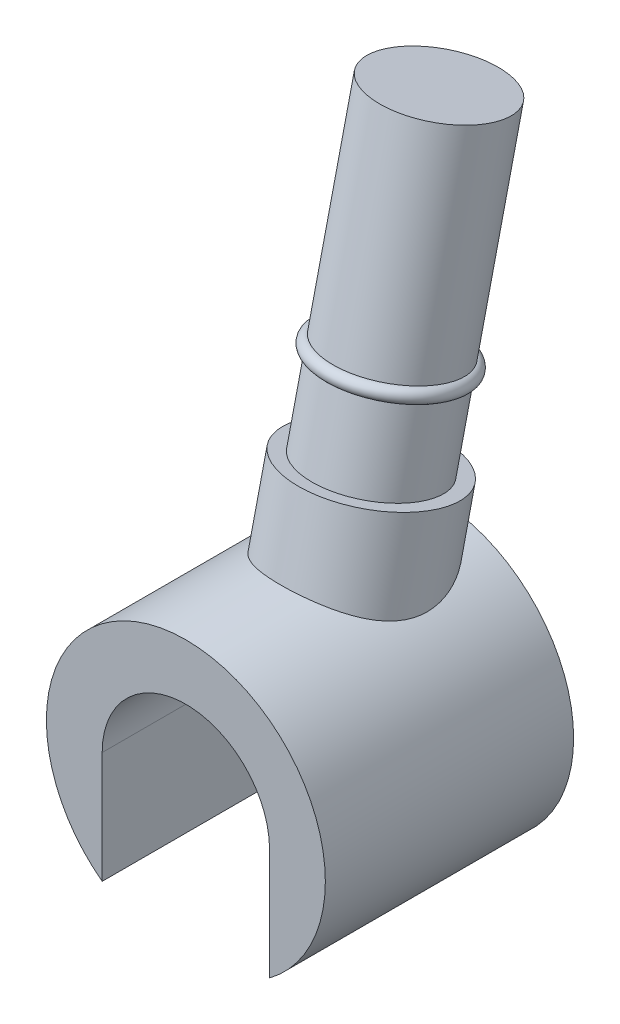
ISO-10303-21;
HEADER;
FILE_DESCRIPTION(('STEP AP214'),'2;1');
FILE_NAME('part.step','',(''),(''),'','','');
FILE_SCHEMA(('AUTOMOTIVE_DESIGN { 1 0 10303 214 1 1 1 1 }'));
ENDSEC;
DATA;
#1=APPLICATION_CONTEXT('core data for automotive mechanical design processes');
#2=APPLICATION_PROTOCOL_DEFINITION('international standard','automotive_design',2000,#1);
#3=PRODUCT_CONTEXT('',#1,'mechanical');
#4=PRODUCT('Part','Part','',(#3));
#5=PRODUCT_RELATED_PRODUCT_CATEGORY('part','',(#4));
#6=PRODUCT_DEFINITION_FORMATION('','',#4);
#7=PRODUCT_DEFINITION_CONTEXT('part definition',#1,'design');
#8=PRODUCT_DEFINITION('design','',#6,#7);
#9=PRODUCT_DEFINITION_SHAPE('','',#8);
#10=(LENGTH_UNIT() NAMED_UNIT(*) SI_UNIT(.MILLI.,.METRE.));
#11=(NAMED_UNIT(*) PLANE_ANGLE_UNIT() SI_UNIT($,.RADIAN.));
#12=(NAMED_UNIT(*) SI_UNIT($,.STERADIAN.) SOLID_ANGLE_UNIT());
#13=UNCERTAINTY_MEASURE_WITH_UNIT(LENGTH_MEASURE(1.E-05),#10,'distance_accuracy_value','');
#14=(GEOMETRIC_REPRESENTATION_CONTEXT(3) GLOBAL_UNCERTAINTY_ASSIGNED_CONTEXT((#13)) GLOBAL_UNIT_ASSIGNED_CONTEXT((#10,
#11,#12)) REPRESENTATION_CONTEXT('',''));
#15=CARTESIAN_POINT('',(0.,0.,0.));
#16=DIRECTION('',(0.,0.,1.));
#17=DIRECTION('',(1.,0.,0.));
#18=AXIS2_PLACEMENT_3D('',#15,#16,#17);
#19=CARTESIAN_POINT('',(0.,0.,4.45));
#20=DIRECTION('',(0.,0.,-1.));
#21=DIRECTION('',(-1.,0.,0.));
#22=AXIS2_PLACEMENT_3D('',#19,#20,#21);
#23=CYLINDRICAL_SURFACE('',#22,2.5);
#24=CARTESIAN_POINT('',(0.,0.,0.));
#25=DIRECTION('',(0.,0.,1.));
#26=DIRECTION('',(1.,0.,0.));
#27=AXIS2_PLACEMENT_3D('',#24,#25,#26);
#28=CIRCLE('',#27,2.5);
#29=CARTESIAN_POINT('',(1.5,-2.,0.));
#30=VERTEX_POINT('',#29);
#31=CARTESIAN_POINT('',(0.,2.5,0.));
#32=VERTEX_POINT('',#31);
#33=EDGE_CURVE('E91',#30,#32,#28,.T.);
#34=ORIENTED_EDGE('',*,*,#33,.T.);
#35=CARTESIAN_POINT('',(0.,2.5,0.));
#36=CARTESIAN_POINT('',(-0.0650425221113213,2.50000086684957,-1.39372361700908E-06));
#37=CARTESIAN_POINT('',(-0.130078748790929,2.49743650572892,0.00548277536239233));
#38=CARTESIAN_POINT('',(-0.257998343345904,2.48748036185817,0.0269943000630155));
#39=CARTESIAN_POINT('',(-0.320880757238264,2.48008646834667,0.0430262656455089));
#40=CARTESIAN_POINT('',(-0.442395643188031,2.46131102338396,0.0844347075372784));
#41=CARTESIAN_POINT('',(-0.501050051102287,2.44995215895047,0.109758061080372));
#42=CARTESIAN_POINT('',(-0.613440271347467,2.42425663063652,0.168441700449666));
#43=CARTESIAN_POINT('',(-0.66717465581013,2.40991910622365,0.201804309256353));
#44=CARTESIAN_POINT('',(-0.774131533049674,2.37784277169539,0.278908753351432));
#45=CARTESIAN_POINT('',(-0.82679067720754,2.35990848859132,0.323346332731007));
#46=CARTESIAN_POINT('',(-0.925135844923924,2.32311974855408,0.419048316363156));
#47=CARTESIAN_POINT('',(-0.970815864801234,2.30426451758374,0.470318528093854));
#48=CARTESIAN_POINT('',(-1.06371061691364,2.26309722672742,0.589936267224527));
#49=CARTESIAN_POINT('',(-1.10926153773649,2.24088359070398,0.659616077773304));
#50=CARTESIAN_POINT('',(-1.1891585795085,2.19952911138362,0.805999736187725));
#51=CARTESIAN_POINT('',(-1.22350429021481,2.18038838060433,0.882703841093754));
#52=CARTESIAN_POINT('',(-1.27601691134564,2.15001720839032,1.03091595816062));
#53=CARTESIAN_POINT('',(-1.29574628487218,2.13806602189414,1.10171784538826));
#54=CARTESIAN_POINT('',(-1.32487754813117,2.12014143136501,1.24614230837811));
#55=CARTESIAN_POINT('',(-1.33429163822691,2.11416096622929,1.3197614451096));
#56=CARTESIAN_POINT('',(-1.34170030193196,2.10947103321034,1.46844983985997));
#57=CARTESIAN_POINT('',(-1.33960539173339,2.11081854033797,1.54352592561868));
#58=CARTESIAN_POINT('',(-1.32305434141091,2.12123098054431,1.691760080974));
#59=CARTESIAN_POINT('',(-1.30860374218131,2.13029245429574,1.76491899516941));
#60=CARTESIAN_POINT('',(-1.27011520964704,2.15342340306325,1.89768406107111));
#61=CARTESIAN_POINT('',(-1.24749443636823,2.16672917526351,1.95784370967791));
#62=CARTESIAN_POINT('',(-1.19356009750961,2.19689921874743,2.07316014398523));
#63=CARTESIAN_POINT('',(-1.16224385207207,2.21376458667796,2.12831538041199));
#64=CARTESIAN_POINT('',(-1.09038687913652,2.25005179783662,2.23466625873654));
#65=CARTESIAN_POINT('',(-1.04953631184657,2.26954727236211,2.28562635597405));
#66=CARTESIAN_POINT('',(-0.960337082224478,2.30870664594321,2.38042175792308));
#67=CARTESIAN_POINT('',(-0.911985567868124,2.32837060636285,2.42425433955927));
#68=CARTESIAN_POINT('',(-0.803401830020293,2.36816827572674,2.50842407667775));
#69=CARTESIAN_POINT('',(-0.742456948642042,2.38813808535114,2.54792337854659));
#70=CARTESIAN_POINT('',(-0.61410700126915,2.42431807026331,2.61690312134114));
#71=CARTESIAN_POINT('',(-0.546701203974827,2.44052781924459,2.64638242640025));
#72=CARTESIAN_POINT('',(-0.406093644135391,2.46785103351893,2.69504163631559));
#73=CARTESIAN_POINT('',(-0.332820031949965,2.4788842941993,2.71406019062112));
#74=CARTESIAN_POINT('',(-0.183549167028041,2.49438051416564,2.74056557186215));
#75=CARTESIAN_POINT('',(-0.107552790083711,2.49884556705727,2.74805607338113));
#76=CARTESIAN_POINT('',(0.0413944578325219,2.50071781936729,2.75120851726341));
#77=CARTESIAN_POINT('',(0.114331306865874,2.49842854959521,2.74737914557545));
#78=CARTESIAN_POINT('',(0.258385806181641,2.48766029375312,2.72909847929603));
#79=CARTESIAN_POINT('',(0.329503506489331,2.47918147808097,2.71464747711737));
#80=CARTESIAN_POINT('',(0.467445172789128,2.45689722994641,2.67566142098373));
#81=CARTESIAN_POINT('',(0.534296859853769,2.44313141301358,2.65120127842578));
#82=CARTESIAN_POINT('',(0.662645768841514,2.41148786619361,2.59274190154606));
#83=CARTESIAN_POINT('',(0.72414143179201,2.39360894458673,2.55873990196372));
#84=CARTESIAN_POINT('',(0.842878728840285,2.35449117302657,2.4801278921424));
#85=CARTESIAN_POINT('',(0.899823504377012,2.33314086040562,2.43512442212177));
#86=CARTESIAN_POINT('',(1.00497269348323,2.28981830601398,2.3360539932009));
#87=CARTESIAN_POINT('',(1.05317418944555,2.26784585945631,2.28198402037529));
#88=CARTESIAN_POINT('',(1.1399077047603,2.22552616270229,2.1650244524769));
#89=CARTESIAN_POINT('',(1.17833586669449,2.20519781715501,2.10205036780901));
#90=CARTESIAN_POINT('',(1.24347191229452,2.16914179537789,1.96914182355493));
#91=CARTESIAN_POINT('',(1.2701949992003,2.15340816017891,1.89921653839201));
#92=CARTESIAN_POINT('',(1.30906320213957,2.12998199443134,1.76147597971898));
#93=CARTESIAN_POINT('',(1.32234852612107,2.12166942870713,1.69408720001249));
#94=CARTESIAN_POINT('',(1.33842960556497,2.11156334703702,1.55760204751726));
#95=CARTESIAN_POINT('',(1.3412258347652,2.10976953667299,1.48850575199001));
#96=CARTESIAN_POINT('',(1.33697151360402,2.11246444816859,1.35465814090234));
#97=CARTESIAN_POINT('',(1.33046078047114,2.11660878111486,1.28987918997454));
#98=CARTESIAN_POINT('',(1.30930772716969,2.12975698544977,1.16219272032001));
#99=CARTESIAN_POINT('',(1.29466242544394,2.1387626386203,1.09928589669509));
#100=CARTESIAN_POINT('',(1.25559531520569,2.16195739057048,0.968296654348325));
#101=CARTESIAN_POINT('',(1.23014342122471,2.17667130327467,0.900617093443925));
#102=CARTESIAN_POINT('',(1.17065622141141,2.20923351578045,0.769909501777195));
#103=CARTESIAN_POINT('',(1.13661139786116,2.22708528443984,0.70688672970358));
#104=CARTESIAN_POINT('',(1.05300031888526,2.26798650780197,0.574522897992111));
#105=CARTESIAN_POINT('',(1.00169883289038,2.29136816632515,0.50637216733103));
#106=CARTESIAN_POINT('',(0.888134006116918,2.33772805865841,0.379726448317377));
#107=CARTESIAN_POINT('',(0.825877091998171,2.36070652034793,0.321225837790448));
#108=CARTESIAN_POINT('',(0.704300422153993,2.39941441531256,0.226604421511677));
#109=CARTESIAN_POINT('',(0.646820249102492,2.4156799625491,0.188345209245952));
#110=CARTESIAN_POINT('',(0.525843348299644,2.44486117128936,0.121187865995123));
#111=CARTESIAN_POINT('',(0.462353113772272,2.45778039298749,0.0922797780214711));
#112=CARTESIAN_POINT('',(0.333430293093495,2.47848714999012,0.0465085217665024));
#113=CARTESIAN_POINT('',(0.268194312007153,2.48646910325998,0.0291864757891232));
#114=CARTESIAN_POINT('',(0.13530220107439,2.49722336140863,0.00593669302317965));
#115=CARTESIAN_POINT('',(0.0676476956181575,2.49999909843017,1.44954697263894E-06));
#116=CARTESIAN_POINT('',(0.,2.5,0.));
#117=B_SPLINE_CURVE_WITH_KNOTS('',3,(#35,#36,#37,#38,#39,#40,#41,#42,#43,#44,#45,#46,#47,#48,
#49,#50,#51,#52,#53,#54,#55,#56,#57,#58,#59,#60,#61,#62,#63,#64,#65,#66,#67,#68,#69,#70,#71,#72,
#73,#74,#75,#76,#77,#78,#79,#80,#81,#82,#83,#84,#85,#86,#87,#88,#89,#90,#91,#92,#93,#94,#95,#96,
#97,#98,#99,#100,#101,#102,#103,#104,#105,#106,#107,#108,#109,#110,#111,#112,#113,#114,#115,
#116),.UNSPECIFIED.,.T.,.F.,(4,2,2,2,2,2,2,2,2,2,2,2,2,2,2,2,2,2,2,2,2,2,2,2,2,2,2,2,2,2,2,2,2,
2,2,2,2,2,2,2,4),(0.,0.194848668308557,0.389782552836045,0.583618857119606,0.777511238618171,
0.990354414521993,1.20337966680445,1.46079617635313,1.71822210932501,1.94073565744603,
2.16298574346113,2.38696628312434,2.61084643162588,2.80686115899994,3.00293636333537,
3.2065925970674,3.41032645600559,3.63525244964131,3.8602039323854,4.0885342470708,
4.31679176605368,4.53495013527132,4.75310249882797,4.96965116841088,5.18626265941183,
5.41219366091126,5.63819991679091,5.86651597353581,6.09453459416895,6.30097592172895,
6.50740792529641,6.70234108433007,6.89734573925797,7.11791870088758,7.33873705441082,
7.60292731572038,7.86696311158337,8.0789584974051,8.29072740377422,8.49351415385408,
8.69616717187175),.UNSPECIFIED.);
#118=EDGE_CURVE('E93',#32,#32,#117,.T.);
#119=ORIENTED_EDGE('',*,*,#118,.F.);
#120=CARTESIAN_POINT('',(-1.5,-2.,0.));
#121=VERTEX_POINT('',#120);
#122=EDGE_CURVE('E73',#32,#121,#28,.T.);
#123=ORIENTED_EDGE('',*,*,#122,.T.);
#124=DIRECTION('',(0.,0.,-1.));
#125=VECTOR('',#124,1.);
#126=CARTESIAN_POINT('',(-1.5,-2.,4.45));
#127=LINE('',#126,#125);
#128=CARTESIAN_POINT('',(-1.5,-2.,4.45));
#129=VERTEX_POINT('',#128);
#130=EDGE_CURVE('E108',#129,#121,#127,.T.);
#131=ORIENTED_EDGE('',*,*,#130,.F.);
#132=CARTESIAN_POINT('',(0.,0.,4.45));
#133=DIRECTION('',(0.,0.,1.));
#134=DIRECTION('',(1.,0.,0.));
#135=AXIS2_PLACEMENT_3D('',#132,#133,#134);
#136=CIRCLE('',#135,2.5);
#137=CARTESIAN_POINT('',(1.5,-2.,4.45));
#138=VERTEX_POINT('',#137);
#139=EDGE_CURVE('E110',#138,#129,#136,.T.);
#140=ORIENTED_EDGE('',*,*,#139,.F.);
#141=DIRECTION('',(0.,0.,-1.));
#142=VECTOR('',#141,1.);
#143=CARTESIAN_POINT('',(1.5,-2.,4.45));
#144=LINE('',#143,#142);
#145=EDGE_CURVE('E47',#138,#30,#144,.T.);
#146=ORIENTED_EDGE('',*,*,#145,.T.);
#147=EDGE_LOOP('',(#34,#119,#123,#131,#140,#146));
#148=FACE_BOUND('',#147,.T.);
#149=ADVANCED_FACE('F38',(#148),#23,.T.);
#150=CARTESIAN_POINT('',(0.,0.,4.45));
#151=DIRECTION('',(0.,0.,-1.));
#152=DIRECTION('',(-1.,0.,0.));
#153=AXIS2_PLACEMENT_3D('',#150,#151,#152);
#154=CYLINDRICAL_SURFACE('',#153,1.5);
#155=CARTESIAN_POINT('',(0.,0.,0.));
#156=DIRECTION('',(0.,0.,-1.));
#157=DIRECTION('',(1.,0.,0.));
#158=AXIS2_PLACEMENT_3D('',#155,#156,#157);
#159=CIRCLE('',#158,1.5);
#160=CARTESIAN_POINT('',(-1.5,0.,0.));
#161=VERTEX_POINT('',#160);
#162=CARTESIAN_POINT('',(1.5,0.,0.));
#163=VERTEX_POINT('',#162);
#164=EDGE_CURVE('E100',#161,#163,#159,.T.);
#165=ORIENTED_EDGE('',*,*,#164,.T.);
#166=DIRECTION('',(0.,0.,-1.));
#167=VECTOR('',#166,1.);
#168=CARTESIAN_POINT('',(1.5,0.,4.45));
#169=LINE('',#168,#167);
#170=CARTESIAN_POINT('',(1.5,0.,4.45));
#171=VERTEX_POINT('',#170);
#172=EDGE_CURVE('E11',#171,#163,#169,.T.);
#173=ORIENTED_EDGE('',*,*,#172,.F.);
#174=CARTESIAN_POINT('',(0.,0.,4.45));
#175=DIRECTION('',(0.,0.,-1.));
#176=DIRECTION('',(1.,0.,0.));
#177=AXIS2_PLACEMENT_3D('',#174,#175,#176);
#178=CIRCLE('',#177,1.5);
#179=CARTESIAN_POINT('',(-1.5,0.,4.45));
#180=VERTEX_POINT('',#179);
#181=EDGE_CURVE('E105',#180,#171,#178,.T.);
#182=ORIENTED_EDGE('',*,*,#181,.F.);
#183=DIRECTION('',(0.,0.,-1.));
#184=VECTOR('',#183,1.);
#185=CARTESIAN_POINT('',(-1.5,0.,4.45));
#186=LINE('',#185,#184);
#187=EDGE_CURVE('E106',#180,#161,#186,.T.);
#188=ORIENTED_EDGE('',*,*,#187,.T.);
#189=EDGE_LOOP('',(#165,#173,#182,#188));
#190=FACE_BOUND('',#189,.T.);
#191=ADVANCED_FACE('F40',(#190),#154,.F.);
#192=CARTESIAN_POINT('',(1.5,0.,4.45));
#193=DIRECTION('',(1.,0.,0.));
#194=DIRECTION('',(0.,0.,-1.));
#195=AXIS2_PLACEMENT_3D('',#192,#193,#194);
#196=PLANE('',#195);
#197=DIRECTION('',(0.,-1.,0.));
#198=VECTOR('',#197,1.);
#199=CARTESIAN_POINT('',(1.5,0.,0.));
#200=LINE('',#199,#198);
#201=EDGE_CURVE('E99',#163,#30,#200,.T.);
#202=ORIENTED_EDGE('',*,*,#201,.T.);
#203=ORIENTED_EDGE('',*,*,#145,.F.);
#204=DIRECTION('',(0.,-1.,0.));
#205=VECTOR('',#204,1.);
#206=CARTESIAN_POINT('',(1.5,0.,4.45));
#207=LINE('',#206,#205);
#208=EDGE_CURVE('E86',#171,#138,#207,.T.);
#209=ORIENTED_EDGE('',*,*,#208,.F.);
#210=ORIENTED_EDGE('',*,*,#172,.T.);
#211=EDGE_LOOP('',(#202,#203,#209,#210));
#212=FACE_BOUND('',#211,.T.);
#213=ADVANCED_FACE('F145',(#212),#196,.F.);
#214=CARTESIAN_POINT('',(-1.5,0.,4.45));
#215=DIRECTION('',(-1.,0.,0.));
#216=DIRECTION('',(0.,0.,1.));
#217=AXIS2_PLACEMENT_3D('',#214,#215,#216);
#218=PLANE('',#217);
#219=DIRECTION('',(0.,1.,0.));
#220=VECTOR('',#219,1.);
#221=CARTESIAN_POINT('',(-1.5,0.,0.));
#222=LINE('',#221,#220);
#223=EDGE_CURVE('E79',#121,#161,#222,.T.);
#224=ORIENTED_EDGE('',*,*,#223,.T.);
#225=ORIENTED_EDGE('',*,*,#187,.F.);
#226=DIRECTION('',(0.,1.,0.));
#227=VECTOR('',#226,1.);
#228=CARTESIAN_POINT('',(-1.5,0.,4.45));
#229=LINE('',#228,#227);
#230=EDGE_CURVE('E55',#129,#180,#229,.T.);
#231=ORIENTED_EDGE('',*,*,#230,.F.);
#232=ORIENTED_EDGE('',*,*,#130,.T.);
#233=EDGE_LOOP('',(#224,#225,#231,#232));
#234=FACE_BOUND('',#233,.T.);
#235=ADVANCED_FACE('F109',(#234),#218,.F.);
#236=CARTESIAN_POINT('',(0.,0.,4.45));
#237=DIRECTION('',(0.,0.,1.));
#238=DIRECTION('',(1.,0.,0.));
#239=AXIS2_PLACEMENT_3D('',#236,#237,#238);
#240=PLANE('',#239);
#241=ORIENTED_EDGE('',*,*,#181,.T.);
#242=ORIENTED_EDGE('',*,*,#208,.T.);
#243=ORIENTED_EDGE('',*,*,#139,.T.);
#244=ORIENTED_EDGE('',*,*,#230,.T.);
#245=EDGE_LOOP('',(#241,#242,#243,#244));
#246=FACE_BOUND('',#245,.T.);
#247=ADVANCED_FACE('F140',(#246),#240,.T.);
#248=CARTESIAN_POINT('',(0.,0.,0.));
#249=DIRECTION('',(0.,0.,1.));
#250=DIRECTION('',(1.,0.,0.));
#251=AXIS2_PLACEMENT_3D('',#248,#249,#250);
#252=PLANE('',#251);
#253=ORIENTED_EDGE('',*,*,#164,.F.);
#254=ORIENTED_EDGE('',*,*,#223,.F.);
#255=ORIENTED_EDGE('',*,*,#122,.F.);
#256=ORIENTED_EDGE('',*,*,#33,.F.);
#257=ORIENTED_EDGE('',*,*,#201,.F.);
#258=EDGE_LOOP('',(#253,#254,#255,#256,#257));
#259=FACE_BOUND('',#258,.T.);
#260=ADVANCED_FACE('F98',(#259),#252,.F.);
#261=CARTESIAN_POINT('',(0.,8.83340542110402,-0.0871818532351436));
#262=DIRECTION('',(0.,0.974370064785234,-0.224951054343868));
#263=DIRECTION('',(0.,0.224951054343868,0.974370064785235));
#264=AXIS2_PLACEMENT_3D('',#261,#262,#263);
#265=CYLINDRICAL_SURFACE('',#264,1.3397588390797);
#266=CARTESIAN_POINT('',(0.,3.57180707126376,1.12755384022174));
#267=DIRECTION('',(0.,0.974370064785234,-0.224951054343868));
#268=DIRECTION('',(0.,0.224951054343868,0.974370064785235));
#269=AXIS2_PLACEMENT_3D('',#266,#267,#268);
#270=CIRCLE('',#269,1.3397588390797);
#271=CARTESIAN_POINT('',(0.,3.87318723468125,2.43297474705242));
#272=VERTEX_POINT('',#271);
#273=EDGE_CURVE('E118',#272,#272,#270,.T.);
#274=ORIENTED_EDGE('',*,*,#273,.F.);
#275=EDGE_LOOP('',(#274));
#276=FACE_BOUND('',#275,.T.);
#277=ORIENTED_EDGE('',*,*,#118,.T.);
#278=EDGE_LOOP('',(#277));
#279=FACE_BOUND('',#278,.T.);
#280=ADVANCED_FACE('F132',(#276,#279),#265,.T.);
#281=CARTESIAN_POINT('',(0.,3.27042690784626,-0.177867066608931));
#282=DIRECTION('',(0.,-0.974370064785234,0.224951054343868));
#283=DIRECTION('',(0.,-0.224951054343868,-0.974370064785235));
#284=AXIS2_PLACEMENT_3D('',#281,#282,#283);
#285=PLANE('',#284);
#286=CARTESIAN_POINT('',(0.,3.57180707126376,1.12755384022174));
#287=DIRECTION('',(0.,0.974370064785234,-0.224951054343868));
#288=DIRECTION('',(0.,0.224951054343868,0.974370064785235));
#289=AXIS2_PLACEMENT_3D('',#286,#287,#288);
#290=CIRCLE('',#289,1.0897588390797);
#291=CARTESIAN_POINT('',(0.,3.81694947109529,2.18938223085611));
#292=VERTEX_POINT('',#291);
#293=EDGE_CURVE('E122',#292,#292,#290,.T.);
#294=ORIENTED_EDGE('',*,*,#293,.F.);
#295=EDGE_LOOP('',(#294));
#296=FACE_BOUND('',#295,.T.);
#297=ORIENTED_EDGE('',*,*,#273,.T.);
#298=EDGE_LOOP('',(#297));
#299=FACE_BOUND('',#298,.T.);
#300=ADVANCED_FACE('F137',(#296,#299),#285,.F.);
#301=CARTESIAN_POINT('',(0.,8.83340542110402,-0.0871818532351436));
#302=DIRECTION('',(0.,0.974370064785234,-0.224951054343868));
#303=DIRECTION('',(0.,0.224951054343868,0.974370064785235));
#304=AXIS2_PLACEMENT_3D('',#301,#302,#303);
#305=CYLINDRICAL_SURFACE('',#304,1.0897588390797);
#306=CARTESIAN_POINT('',(0.,4.96028441358272,0.806998587781733));
#307=DIRECTION('',(0.,0.974370064785234,-0.224951054343868));
#308=DIRECTION('',(0.,0.224951054343868,0.974370064785235));
#309=AXIS2_PLACEMENT_3D('',#306,#307,#308);
#310=CIRCLE('',#309,1.0897588390797);
#311=CARTESIAN_POINT('',(0.,5.20542681341425,1.8688269784161));
#312=VERTEX_POINT('',#311);
#313=EDGE_CURVE('E263',#312,#312,#310,.T.);
#314=ORIENTED_EDGE('',*,*,#313,.F.);
#315=EDGE_LOOP('',(#314));
#316=FACE_BOUND('',#315,.T.);
#317=ORIENTED_EDGE('',*,*,#293,.T.);
#318=EDGE_LOOP('',(#317));
#319=FACE_BOUND('',#318,.T.);
#320=ADVANCED_FACE('F200',(#316,#319),#305,.T.);
#321=CARTESIAN_POINT('',(0.,5.08208067168087,0.778879705988749));
#322=DIRECTION('',(0.,0.974370064785234,-0.224951054343868));
#323=DIRECTION('',(0.,0.224951054343868,0.974370064785235));
#324=AXIS2_PLACEMENT_3D('',#321,#322,#323);
#325=TOROIDAL_SURFACE('',#324,1.0897588390797,0.125);
#326=CARTESIAN_POINT('',(0.,5.20387692977903,0.750760824195766));
#327=DIRECTION('',(0.,0.974370064785234,-0.224951054343868));
#328=DIRECTION('',(0.,0.224951054343868,0.974370064785235));
#329=AXIS2_PLACEMENT_3D('',#326,#327,#328);
#330=CIRCLE('',#329,1.0897588390797);
#331=CARTESIAN_POINT('',(0.,5.44901932961055,1.81258921483013));
#332=VERTEX_POINT('',#331);
#333=EDGE_CURVE('E260',#332,#332,#330,.T.);
#334=ORIENTED_EDGE('',*,*,#333,.F.);
#335=EDGE_LOOP('',(#334));
#336=FACE_BOUND('',#335,.T.);
#337=ORIENTED_EDGE('',*,*,#313,.T.);
#338=EDGE_LOOP('',(#337));
#339=FACE_BOUND('',#338,.T.);
#340=ADVANCED_FACE('F210',(#336,#339),#325,.T.);
#341=CARTESIAN_POINT('',(0.,8.83340542110402,-0.0871818532351436));
#342=DIRECTION('',(0.,0.974370064785234,-0.224951054343868));
#343=DIRECTION('',(0.,0.224951054343868,0.974370064785235));
#344=AXIS2_PLACEMENT_3D('',#341,#342,#343);
#345=CYLINDRICAL_SURFACE('',#344,1.0897588390797);
#346=CARTESIAN_POINT('',(0.,8.83340542110402,-0.0871818532351434));
#347=DIRECTION('',(0.,0.974370064785234,-0.224951054343868));
#348=DIRECTION('',(0.,0.224951054343868,0.974370064785235));
#349=AXIS2_PLACEMENT_3D('',#346,#347,#348);
#350=CIRCLE('',#349,1.0897588390797);
#351=CARTESIAN_POINT('',(0.,9.07854782093555,0.974646537399226));
#352=VERTEX_POINT('',#351);
#353=EDGE_CURVE('E259',#352,#352,#350,.T.);
#354=ORIENTED_EDGE('',*,*,#353,.F.);
#355=EDGE_LOOP('',(#354));
#356=FACE_BOUND('',#355,.T.);
#357=ORIENTED_EDGE('',*,*,#333,.T.);
#358=EDGE_LOOP('',(#357));
#359=FACE_BOUND('',#358,.T.);
#360=ADVANCED_FACE('F220',(#356,#359),#345,.T.);
#361=CARTESIAN_POINT('',(0.,8.58826302127249,-1.14901024386951));
#362=DIRECTION('',(0.,-0.974370064785234,0.224951054343868));
#363=DIRECTION('',(0.,-0.224951054343868,-0.974370064785235));
#364=AXIS2_PLACEMENT_3D('',#361,#362,#363);
#365=PLANE('',#364);
#366=ORIENTED_EDGE('',*,*,#353,.T.);
#367=EDGE_LOOP('',(#366));
#368=FACE_BOUND('',#367,.T.);
#369=ADVANCED_FACE('F231',(#368),#365,.F.);
#370=CLOSED_SHELL('',(#149,#191,#213,#235,#247,#260,#280,#300,#320,#340,#360,#369));
#371=MANIFOLD_SOLID_BREP('B2',#370);
#372=ADVANCED_BREP_SHAPE_REPRESENTATION('',(#18,#371),#14);
#373=SHAPE_DEFINITION_REPRESENTATION(#9,#372);
ENDSEC;
END-ISO-10303-21;
